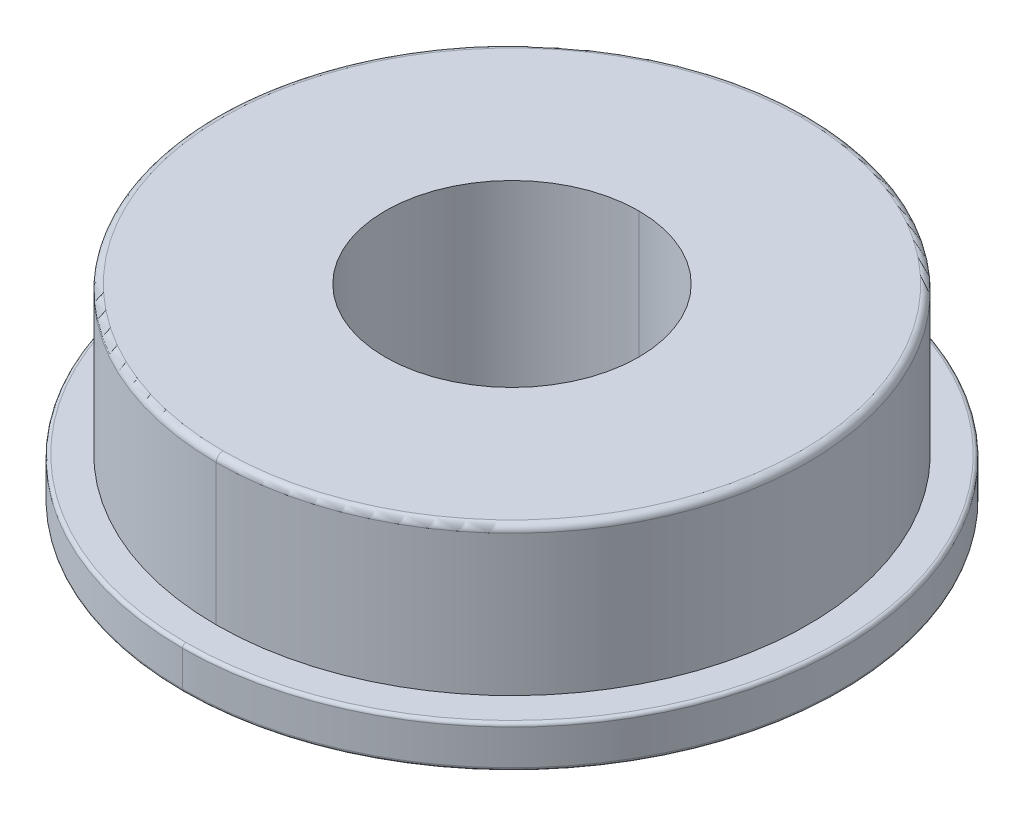
ISO-10303-21;
HEADER;
FILE_DESCRIPTION(('STEP AP214'),'2;1');
FILE_NAME('part.step','',(''),(''),'','','');
FILE_SCHEMA(('AUTOMOTIVE_DESIGN { 1 0 10303 214 1 1 1 1 }'));
ENDSEC;
DATA;
#1=APPLICATION_CONTEXT('core data for automotive mechanical design processes');
#2=APPLICATION_PROTOCOL_DEFINITION('international standard','automotive_design',2000,#1);
#3=PRODUCT_CONTEXT('',#1,'mechanical');
#4=PRODUCT('Part','Part','',(#3));
#5=PRODUCT_RELATED_PRODUCT_CATEGORY('part','',(#4));
#6=PRODUCT_DEFINITION_FORMATION('','',#4);
#7=PRODUCT_DEFINITION_CONTEXT('part definition',#1,'design');
#8=PRODUCT_DEFINITION('design','',#6,#7);
#9=PRODUCT_DEFINITION_SHAPE('','',#8);
#10=(LENGTH_UNIT() NAMED_UNIT(*) SI_UNIT(.MILLI.,.METRE.));
#11=(NAMED_UNIT(*) PLANE_ANGLE_UNIT() SI_UNIT($,.RADIAN.));
#12=(NAMED_UNIT(*) SI_UNIT($,.STERADIAN.) SOLID_ANGLE_UNIT());
#13=UNCERTAINTY_MEASURE_WITH_UNIT(LENGTH_MEASURE(1.E-05),#10,'distance_accuracy_value','');
#14=(GEOMETRIC_REPRESENTATION_CONTEXT(3) GLOBAL_UNCERTAINTY_ASSIGNED_CONTEXT((#13)) GLOBAL_UNIT_ASSIGNED_CONTEXT((#10,
#11,#12)) REPRESENTATION_CONTEXT('',''));
#15=CARTESIAN_POINT('',(0.,0.,0.));
#16=DIRECTION('',(0.,0.,1.));
#17=DIRECTION('',(1.,0.,0.));
#18=AXIS2_PLACEMENT_3D('',#15,#16,#17);
#19=CARTESIAN_POINT('',(0.,7.11325000112419,0.));
#20=DIRECTION('',(0.,-1.,0.));
#21=DIRECTION('',(0.,0.,-1.));
#22=AXIS2_PLACEMENT_3D('',#19,#20,#21);
#23=CYLINDRICAL_SURFACE('',#22,12.3825);
#24=DIRECTION('',(0.,-1.,0.));
#25=VECTOR('',#24,1.);
#26=CARTESIAN_POINT('',(0.,7.11325000112419,12.3825));
#27=LINE('',#26,#25);
#28=CARTESIAN_POINT('',(0.,1.4478,12.3825));
#29=VERTEX_POINT('',#28);
#30=CARTESIAN_POINT('',(0.,0.127,12.3825));
#31=VERTEX_POINT('',#30);
#32=EDGE_CURVE('E119',#29,#31,#27,.T.);
#33=ORIENTED_EDGE('',*,*,#32,.F.);
#34=CARTESIAN_POINT('',(0.,1.4478,0.));
#35=DIRECTION('',(0.,-1.,0.));
#36=DIRECTION('',(0.,0.,-1.));
#37=AXIS2_PLACEMENT_3D('',#34,#35,#36);
#38=CIRCLE('',#37,12.3825);
#39=CARTESIAN_POINT('',(0.,1.4478,-12.3825));
#40=VERTEX_POINT('',#39);
#41=EDGE_CURVE('E114',#29,#40,#38,.T.);
#42=ORIENTED_EDGE('',*,*,#41,.T.);
#43=DIRECTION('',(0.,-1.,0.));
#44=VECTOR('',#43,1.);
#45=CARTESIAN_POINT('',(0.,7.11325000112419,-12.3825));
#46=LINE('',#45,#44);
#47=CARTESIAN_POINT('',(0.,0.127,-12.3825));
#48=VERTEX_POINT('',#47);
#49=EDGE_CURVE('E113',#40,#48,#46,.T.);
#50=ORIENTED_EDGE('',*,*,#49,.T.);
#51=CARTESIAN_POINT('',(0.,0.127,0.));
#52=DIRECTION('',(0.,-1.,0.));
#53=DIRECTION('',(0.,0.,-1.));
#54=AXIS2_PLACEMENT_3D('',#51,#52,#53);
#55=CIRCLE('',#54,12.3825);
#56=EDGE_CURVE('E11',#31,#48,#55,.T.);
#57=ORIENTED_EDGE('',*,*,#56,.F.);
#58=EDGE_LOOP('',(#33,#42,#50,#57));
#59=FACE_BOUND('',#58,.T.);
#60=ADVANCED_FACE('F16',(#59),#23,.T.);
#61=CARTESIAN_POINT('',(0.,0.127,0.));
#62=DIRECTION('',(0.,-1.,0.));
#63=DIRECTION('',(0.,0.,-1.));
#64=AXIS2_PLACEMENT_3D('',#61,#62,#63);
#65=TOROIDAL_SURFACE('',#64,12.2555,0.127);
#66=CARTESIAN_POINT('',(0.,0.127,12.2555));
#67=DIRECTION('',(1.,0.,0.));
#68=DIRECTION('',(0.,0.,-1.));
#69=AXIS2_PLACEMENT_3D('',#66,#67,#68);
#70=CIRCLE('',#69,0.127);
#71=CARTESIAN_POINT('',(0.,0.,12.2555));
#72=VERTEX_POINT('',#71);
#73=EDGE_CURVE('E139',#31,#72,#70,.T.);
#74=ORIENTED_EDGE('',*,*,#73,.F.);
#75=ORIENTED_EDGE('',*,*,#56,.T.);
#76=CARTESIAN_POINT('',(0.,0.127,-12.2555));
#77=DIRECTION('',(-1.,0.,0.));
#78=DIRECTION('',(0.,0.,1.));
#79=AXIS2_PLACEMENT_3D('',#76,#77,#78);
#80=CIRCLE('',#79,0.127);
#81=CARTESIAN_POINT('',(0.,0.,-12.2555));
#82=VERTEX_POINT('',#81);
#83=EDGE_CURVE('E164',#48,#82,#80,.T.);
#84=ORIENTED_EDGE('',*,*,#83,.T.);
#85=CARTESIAN_POINT('',(0.,0.,0.));
#86=DIRECTION('',(0.,-1.,0.));
#87=DIRECTION('',(0.,0.,-1.));
#88=AXIS2_PLACEMENT_3D('',#85,#86,#87);
#89=CIRCLE('',#88,12.2555);
#90=EDGE_CURVE('E25',#72,#82,#89,.T.);
#91=ORIENTED_EDGE('',*,*,#90,.F.);
#92=EDGE_LOOP('',(#74,#75,#84,#91));
#93=FACE_BOUND('',#92,.T.);
#94=ADVANCED_FACE('F18',(#93),#65,.T.);
#95=CARTESIAN_POINT('',(4.7625,0.,0.));
#96=DIRECTION('',(0.,-1.,0.));
#97=DIRECTION('',(0.,0.,-1.));
#98=AXIS2_PLACEMENT_3D('',#95,#96,#97);
#99=PLANE('',#98);
#100=CARTESIAN_POINT('',(0.,0.,0.));
#101=DIRECTION('',(0.,-1.,0.));
#102=DIRECTION('',(0.,0.,-1.));
#103=AXIS2_PLACEMENT_3D('',#100,#101,#102);
#104=CIRCLE('',#103,4.7625);
#105=CARTESIAN_POINT('',(0.,0.,-4.7625));
#106=VERTEX_POINT('',#105);
#107=CARTESIAN_POINT('',(0.,0.,4.7625));
#108=VERTEX_POINT('',#107);
#109=EDGE_CURVE('E221',#106,#108,#104,.T.);
#110=ORIENTED_EDGE('',*,*,#109,.F.);
#111=CARTESIAN_POINT('',(0.,0.,0.));
#112=DIRECTION('',(0.,-1.,0.));
#113=DIRECTION('',(0.,0.,-1.));
#114=AXIS2_PLACEMENT_3D('',#111,#112,#113);
#115=CIRCLE('',#114,4.7625);
#116=EDGE_CURVE('E152',#108,#106,#115,.T.);
#117=ORIENTED_EDGE('',*,*,#116,.F.);
#118=EDGE_LOOP('',(#110,#117));
#119=FACE_BOUND('',#118,.T.);
#120=CARTESIAN_POINT('',(0.,0.,0.));
#121=DIRECTION('',(0.,-1.,0.));
#122=DIRECTION('',(0.,0.,-1.));
#123=AXIS2_PLACEMENT_3D('',#120,#121,#122);
#124=CIRCLE('',#123,12.2555);
#125=EDGE_CURVE('E165',#82,#72,#124,.T.);
#126=ORIENTED_EDGE('',*,*,#125,.T.);
#127=ORIENTED_EDGE('',*,*,#90,.T.);
#128=EDGE_LOOP('',(#126,#127));
#129=FACE_BOUND('',#128,.T.);
#130=ADVANCED_FACE('F230',(#119,#129),#99,.T.);
#131=CARTESIAN_POINT('',(0.,7.11325000112419,0.));
#132=DIRECTION('',(0.,-1.,0.));
#133=DIRECTION('',(0.,0.,-1.));
#134=AXIS2_PLACEMENT_3D('',#131,#132,#133);
#135=CYLINDRICAL_SURFACE('',#134,4.7625);
#136=DIRECTION('',(0.,-1.,0.));
#137=VECTOR('',#136,1.);
#138=CARTESIAN_POINT('',(0.,7.11325000112419,4.7625));
#139=LINE('',#138,#137);
#140=CARTESIAN_POINT('',(0.,7.112,4.7625));
#141=VERTEX_POINT('',#140);
#142=EDGE_CURVE('E168',#141,#108,#139,.T.);
#143=ORIENTED_EDGE('',*,*,#142,.F.);
#144=CARTESIAN_POINT('',(0.,7.112,0.));
#145=DIRECTION('',(0.,-1.,0.));
#146=DIRECTION('',(0.,0.,-1.));
#147=AXIS2_PLACEMENT_3D('',#144,#145,#146);
#148=CIRCLE('',#147,4.7625);
#149=CARTESIAN_POINT('',(0.,7.112,-4.7625));
#150=VERTEX_POINT('',#149);
#151=EDGE_CURVE('E158',#150,#141,#148,.T.);
#152=ORIENTED_EDGE('',*,*,#151,.F.);
#153=DIRECTION('',(0.,-1.,0.));
#154=VECTOR('',#153,1.);
#155=CARTESIAN_POINT('',(0.,7.11325000112419,-4.7625));
#156=LINE('',#155,#154);
#157=EDGE_CURVE('E149',#150,#106,#156,.T.);
#158=ORIENTED_EDGE('',*,*,#157,.T.);
#159=ORIENTED_EDGE('',*,*,#109,.T.);
#160=EDGE_LOOP('',(#143,#152,#158,#159));
#161=FACE_BOUND('',#160,.T.);
#162=ADVANCED_FACE('F265',(#161),#135,.F.);
#163=CARTESIAN_POINT('',(10.8585,7.112,0.));
#164=DIRECTION('',(0.,1.,0.));
#165=DIRECTION('',(1.,0.,0.));
#166=AXIS2_PLACEMENT_3D('',#163,#164,#165);
#167=PLANE('',#166);
#168=ORIENTED_EDGE('',*,*,#151,.T.);
#169=CARTESIAN_POINT('',(0.,7.112,0.));
#170=DIRECTION('',(0.,-1.,0.));
#171=DIRECTION('',(0.,0.,-1.));
#172=AXIS2_PLACEMENT_3D('',#169,#170,#171);
#173=CIRCLE('',#172,4.7625);
#174=EDGE_CURVE('E179',#141,#150,#173,.T.);
#175=ORIENTED_EDGE('',*,*,#174,.T.);
#176=EDGE_LOOP('',(#168,#175));
#177=FACE_BOUND('',#176,.T.);
#178=CARTESIAN_POINT('',(0.,7.112,0.));
#179=DIRECTION('',(0.,-1.,0.));
#180=DIRECTION('',(0.,0.,-1.));
#181=AXIS2_PLACEMENT_3D('',#178,#179,#180);
#182=CIRCLE('',#181,10.8585);
#183=CARTESIAN_POINT('',(0.,7.112,-10.8585));
#184=VERTEX_POINT('',#183);
#185=CARTESIAN_POINT('',(0.,7.112,10.8585));
#186=VERTEX_POINT('',#185);
#187=EDGE_CURVE('E153',#184,#186,#182,.T.);
#188=ORIENTED_EDGE('',*,*,#187,.F.);
#189=CARTESIAN_POINT('',(0.,7.112,0.));
#190=DIRECTION('',(0.,-1.,0.));
#191=DIRECTION('',(0.,0.,-1.));
#192=AXIS2_PLACEMENT_3D('',#189,#190,#191);
#193=CIRCLE('',#192,10.8585);
#194=EDGE_CURVE('E154',#186,#184,#193,.T.);
#195=ORIENTED_EDGE('',*,*,#194,.F.);
#196=EDGE_LOOP('',(#188,#195));
#197=FACE_BOUND('',#196,.T.);
#198=ADVANCED_FACE('F259',(#177,#197),#167,.T.);
#199=CARTESIAN_POINT('',(0.,6.858,0.));
#200=DIRECTION('',(0.,-1.,0.));
#201=DIRECTION('',(0.,0.,-1.));
#202=AXIS2_PLACEMENT_3D('',#199,#200,#201);
#203=TOROIDAL_SURFACE('',#202,10.8585,0.254);
#204=CARTESIAN_POINT('',(0.,6.858,10.8585));
#205=DIRECTION('',(1.,0.,0.));
#206=DIRECTION('',(0.,0.,-1.));
#207=AXIS2_PLACEMENT_3D('',#204,#205,#206);
#208=CIRCLE('',#207,0.254);
#209=CARTESIAN_POINT('',(0.,6.858,11.1125));
#210=VERTEX_POINT('',#209);
#211=EDGE_CURVE('E194',#186,#210,#208,.T.);
#212=ORIENTED_EDGE('',*,*,#211,.F.);
#213=ORIENTED_EDGE('',*,*,#194,.T.);
#214=CARTESIAN_POINT('',(0.,6.858,-10.8585));
#215=DIRECTION('',(-1.,0.,0.));
#216=DIRECTION('',(0.,0.,1.));
#217=AXIS2_PLACEMENT_3D('',#214,#215,#216);
#218=CIRCLE('',#217,0.254);
#219=CARTESIAN_POINT('',(0.,6.858,-11.1125));
#220=VERTEX_POINT('',#219);
#221=EDGE_CURVE('E185',#184,#220,#218,.T.);
#222=ORIENTED_EDGE('',*,*,#221,.T.);
#223=CARTESIAN_POINT('',(0.,6.858,0.));
#224=DIRECTION('',(0.,-1.,0.));
#225=DIRECTION('',(0.,0.,-1.));
#226=AXIS2_PLACEMENT_3D('',#223,#224,#225);
#227=CIRCLE('',#226,11.1125);
#228=EDGE_CURVE('E157',#210,#220,#227,.T.);
#229=ORIENTED_EDGE('',*,*,#228,.F.);
#230=EDGE_LOOP('',(#212,#213,#222,#229));
#231=FACE_BOUND('',#230,.T.);
#232=ADVANCED_FACE('F269',(#231),#203,.T.);
#233=CARTESIAN_POINT('',(0.,7.11325000112419,0.));
#234=DIRECTION('',(0.,-1.,0.));
#235=DIRECTION('',(0.,0.,-1.));
#236=AXIS2_PLACEMENT_3D('',#233,#234,#235);
#237=CYLINDRICAL_SURFACE('',#236,11.1125);
#238=DIRECTION('',(0.,-1.,0.));
#239=VECTOR('',#238,1.);
#240=CARTESIAN_POINT('',(0.,7.11325000112419,11.1125));
#241=LINE('',#240,#239);
#242=CARTESIAN_POINT('',(0.,1.5748,11.1125));
#243=VERTEX_POINT('',#242);
#244=EDGE_CURVE('E184',#210,#243,#241,.T.);
#245=ORIENTED_EDGE('',*,*,#244,.F.);
#246=ORIENTED_EDGE('',*,*,#228,.T.);
#247=DIRECTION('',(0.,-1.,0.));
#248=VECTOR('',#247,1.);
#249=CARTESIAN_POINT('',(0.,7.11325000112419,-11.1125));
#250=LINE('',#249,#248);
#251=CARTESIAN_POINT('',(0.,1.5748,-11.1125));
#252=VERTEX_POINT('',#251);
#253=EDGE_CURVE('E210',#220,#252,#250,.T.);
#254=ORIENTED_EDGE('',*,*,#253,.T.);
#255=CARTESIAN_POINT('',(0.,1.5748,0.));
#256=DIRECTION('',(0.,-1.,0.));
#257=DIRECTION('',(0.,0.,-1.));
#258=AXIS2_PLACEMENT_3D('',#255,#256,#257);
#259=CIRCLE('',#258,11.1125);
#260=EDGE_CURVE('E124',#243,#252,#259,.T.);
#261=ORIENTED_EDGE('',*,*,#260,.F.);
#262=EDGE_LOOP('',(#245,#246,#254,#261));
#263=FACE_BOUND('',#262,.T.);
#264=ADVANCED_FACE('F288',(#263),#237,.T.);
#265=CARTESIAN_POINT('',(12.2555,1.5748,0.));
#266=DIRECTION('',(0.,1.,0.));
#267=DIRECTION('',(1.,0.,0.));
#268=AXIS2_PLACEMENT_3D('',#265,#266,#267);
#269=PLANE('',#268);
#270=CARTESIAN_POINT('',(0.,1.5748,0.));
#271=DIRECTION('',(0.,-1.,0.));
#272=DIRECTION('',(0.,0.,-1.));
#273=AXIS2_PLACEMENT_3D('',#270,#271,#272);
#274=CIRCLE('',#273,11.1125);
#275=EDGE_CURVE('E201',#252,#243,#274,.T.);
#276=ORIENTED_EDGE('',*,*,#275,.T.);
#277=ORIENTED_EDGE('',*,*,#260,.T.);
#278=EDGE_LOOP('',(#276,#277));
#279=FACE_BOUND('',#278,.T.);
#280=CARTESIAN_POINT('',(0.,1.5748,0.));
#281=DIRECTION('',(0.,-1.,0.));
#282=DIRECTION('',(0.,0.,-1.));
#283=AXIS2_PLACEMENT_3D('',#280,#281,#282);
#284=CIRCLE('',#283,12.2555);
#285=CARTESIAN_POINT('',(0.,1.5748,-12.2555));
#286=VERTEX_POINT('',#285);
#287=CARTESIAN_POINT('',(0.,1.5748,12.2555));
#288=VERTEX_POINT('',#287);
#289=EDGE_CURVE('E204',#286,#288,#284,.T.);
#290=ORIENTED_EDGE('',*,*,#289,.F.);
#291=CARTESIAN_POINT('',(0.,1.5748,0.));
#292=DIRECTION('',(0.,-1.,0.));
#293=DIRECTION('',(0.,0.,-1.));
#294=AXIS2_PLACEMENT_3D('',#291,#292,#293);
#295=CIRCLE('',#294,12.2555);
#296=EDGE_CURVE('E40',#288,#286,#295,.T.);
#297=ORIENTED_EDGE('',*,*,#296,.F.);
#298=EDGE_LOOP('',(#290,#297));
#299=FACE_BOUND('',#298,.T.);
#300=ADVANCED_FACE('F295',(#279,#299),#269,.T.);
#301=CARTESIAN_POINT('',(0.,1.4478,0.));
#302=DIRECTION('',(0.,-1.,0.));
#303=DIRECTION('',(0.,0.,-1.));
#304=AXIS2_PLACEMENT_3D('',#301,#302,#303);
#305=TOROIDAL_SURFACE('',#304,12.2555,0.127);
#306=CARTESIAN_POINT('',(0.,1.4478,12.2555));
#307=DIRECTION('',(1.,0.,0.));
#308=DIRECTION('',(0.,0.,-1.));
#309=AXIS2_PLACEMENT_3D('',#306,#307,#308);
#310=CIRCLE('',#309,0.127);
#311=EDGE_CURVE('E129',#288,#29,#310,.T.);
#312=ORIENTED_EDGE('',*,*,#311,.F.);
#313=ORIENTED_EDGE('',*,*,#296,.T.);
#314=CARTESIAN_POINT('',(0.,1.4478,-12.2555));
#315=DIRECTION('',(-1.,0.,0.));
#316=DIRECTION('',(0.,0.,1.));
#317=AXIS2_PLACEMENT_3D('',#314,#315,#316);
#318=CIRCLE('',#317,0.127);
#319=EDGE_CURVE('E125',#286,#40,#318,.T.);
#320=ORIENTED_EDGE('',*,*,#319,.T.);
#321=ORIENTED_EDGE('',*,*,#41,.F.);
#322=EDGE_LOOP('',(#312,#313,#320,#321));
#323=FACE_BOUND('',#322,.T.);
#324=ADVANCED_FACE('F121',(#323),#305,.T.);
#325=CARTESIAN_POINT('',(0.,1.4478,0.));
#326=DIRECTION('',(0.,-1.,0.));
#327=DIRECTION('',(0.,0.,-1.));
#328=AXIS2_PLACEMENT_3D('',#325,#326,#327);
#329=TOROIDAL_SURFACE('',#328,12.2555,0.127);
#330=ORIENTED_EDGE('',*,*,#289,.T.);
#331=ORIENTED_EDGE('',*,*,#311,.T.);
#332=CARTESIAN_POINT('',(0.,1.4478,0.));
#333=DIRECTION('',(0.,-1.,0.));
#334=DIRECTION('',(0.,0.,-1.));
#335=AXIS2_PLACEMENT_3D('',#332,#333,#334);
#336=CIRCLE('',#335,12.3825);
#337=EDGE_CURVE('E133',#40,#29,#336,.T.);
#338=ORIENTED_EDGE('',*,*,#337,.F.);
#339=ORIENTED_EDGE('',*,*,#319,.F.);
#340=EDGE_LOOP('',(#330,#331,#338,#339));
#341=FACE_BOUND('',#340,.T.);
#342=ADVANCED_FACE('F138',(#341),#329,.T.);
#343=CARTESIAN_POINT('',(0.,7.11325000112419,0.));
#344=DIRECTION('',(0.,-1.,0.));
#345=DIRECTION('',(0.,0.,-1.));
#346=AXIS2_PLACEMENT_3D('',#343,#344,#345);
#347=CYLINDRICAL_SURFACE('',#346,11.1125);
#348=CARTESIAN_POINT('',(0.,6.858,0.));
#349=DIRECTION('',(0.,-1.,0.));
#350=DIRECTION('',(0.,0.,-1.));
#351=AXIS2_PLACEMENT_3D('',#348,#349,#350);
#352=CIRCLE('',#351,11.1125);
#353=EDGE_CURVE('E186',#220,#210,#352,.T.);
#354=ORIENTED_EDGE('',*,*,#353,.T.);
#355=ORIENTED_EDGE('',*,*,#244,.T.);
#356=ORIENTED_EDGE('',*,*,#275,.F.);
#357=ORIENTED_EDGE('',*,*,#253,.F.);
#358=EDGE_LOOP('',(#354,#355,#356,#357));
#359=FACE_BOUND('',#358,.T.);
#360=ADVANCED_FACE('F290',(#359),#347,.T.);
#361=CARTESIAN_POINT('',(0.,6.858,0.));
#362=DIRECTION('',(0.,-1.,0.));
#363=DIRECTION('',(0.,0.,-1.));
#364=AXIS2_PLACEMENT_3D('',#361,#362,#363);
#365=TOROIDAL_SURFACE('',#364,10.8585,0.254);
#366=ORIENTED_EDGE('',*,*,#187,.T.);
#367=ORIENTED_EDGE('',*,*,#211,.T.);
#368=ORIENTED_EDGE('',*,*,#353,.F.);
#369=ORIENTED_EDGE('',*,*,#221,.F.);
#370=EDGE_LOOP('',(#366,#367,#368,#369));
#371=FACE_BOUND('',#370,.T.);
#372=ADVANCED_FACE('F250',(#371),#365,.T.);
#373=CARTESIAN_POINT('',(0.,7.11325000112419,0.));
#374=DIRECTION('',(0.,-1.,0.));
#375=DIRECTION('',(0.,0.,-1.));
#376=AXIS2_PLACEMENT_3D('',#373,#374,#375);
#377=CYLINDRICAL_SURFACE('',#376,4.7625);
#378=ORIENTED_EDGE('',*,*,#174,.F.);
#379=ORIENTED_EDGE('',*,*,#142,.T.);
#380=ORIENTED_EDGE('',*,*,#116,.T.);
#381=ORIENTED_EDGE('',*,*,#157,.F.);
#382=EDGE_LOOP('',(#378,#379,#380,#381));
#383=FACE_BOUND('',#382,.T.);
#384=ADVANCED_FACE('F238',(#383),#377,.F.);
#385=CARTESIAN_POINT('',(0.,0.127,0.));
#386=DIRECTION('',(0.,-1.,0.));
#387=DIRECTION('',(0.,0.,-1.));
#388=AXIS2_PLACEMENT_3D('',#385,#386,#387);
#389=TOROIDAL_SURFACE('',#388,12.2555,0.127);
#390=CARTESIAN_POINT('',(0.,0.127,0.));
#391=DIRECTION('',(0.,-1.,0.));
#392=DIRECTION('',(0.,0.,-1.));
#393=AXIS2_PLACEMENT_3D('',#390,#391,#392);
#394=CIRCLE('',#393,12.3825);
#395=EDGE_CURVE('E137',#48,#31,#394,.T.);
#396=ORIENTED_EDGE('',*,*,#395,.T.);
#397=ORIENTED_EDGE('',*,*,#73,.T.);
#398=ORIENTED_EDGE('',*,*,#125,.F.);
#399=ORIENTED_EDGE('',*,*,#83,.F.);
#400=EDGE_LOOP('',(#396,#397,#398,#399));
#401=FACE_BOUND('',#400,.T.);
#402=ADVANCED_FACE('F240',(#401),#389,.T.);
#403=CARTESIAN_POINT('',(0.,7.11325000112419,0.));
#404=DIRECTION('',(0.,-1.,0.));
#405=DIRECTION('',(0.,0.,-1.));
#406=AXIS2_PLACEMENT_3D('',#403,#404,#405);
#407=CYLINDRICAL_SURFACE('',#406,12.3825);
#408=ORIENTED_EDGE('',*,*,#337,.T.);
#409=ORIENTED_EDGE('',*,*,#32,.T.);
#410=ORIENTED_EDGE('',*,*,#395,.F.);
#411=ORIENTED_EDGE('',*,*,#49,.F.);
#412=EDGE_LOOP('',(#408,#409,#410,#411));
#413=FACE_BOUND('',#412,.T.);
#414=ADVANCED_FACE('F132',(#413),#407,.T.);
#415=CLOSED_SHELL('',(#60,#94,#130,#162,#198,#232,#264,#300,#324,#342,#360,#372,#384,#402,#414));
#416=MANIFOLD_SOLID_BREP('B1',#415);
#417=ADVANCED_BREP_SHAPE_REPRESENTATION('',(#18,#416),#14);
#418=SHAPE_DEFINITION_REPRESENTATION(#9,#417);
ENDSEC;
END-ISO-10303-21;
